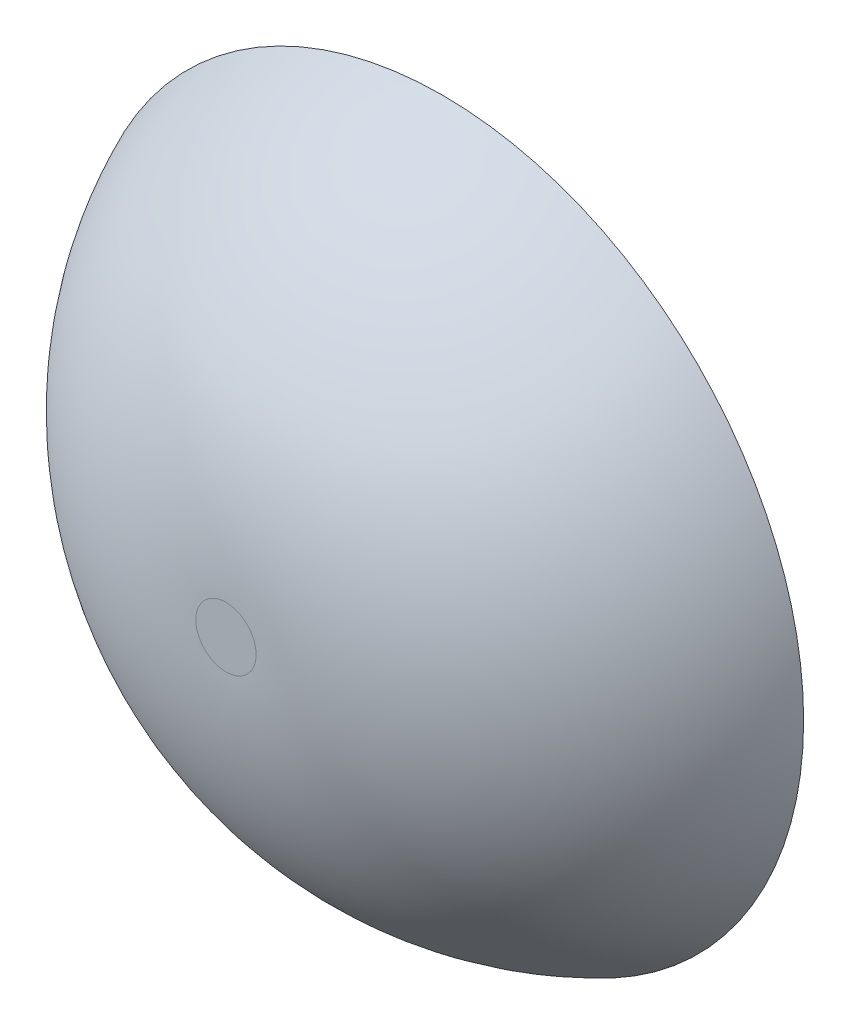
ISO-10303-21;
HEADER;
FILE_DESCRIPTION(('STEP AP214'),'2;1');
FILE_NAME('part.step','',(''),(''),'','','');
FILE_SCHEMA(('AUTOMOTIVE_DESIGN { 1 0 10303 214 1 1 1 1 }'));
ENDSEC;
DATA;
#1=APPLICATION_CONTEXT('core data for automotive mechanical design processes');
#2=APPLICATION_PROTOCOL_DEFINITION('international standard','automotive_design',2000,#1);
#3=PRODUCT_CONTEXT('',#1,'mechanical');
#4=PRODUCT('Part','Part','',(#3));
#5=PRODUCT_RELATED_PRODUCT_CATEGORY('part','',(#4));
#6=PRODUCT_DEFINITION_FORMATION('','',#4);
#7=PRODUCT_DEFINITION_CONTEXT('part definition',#1,'design');
#8=PRODUCT_DEFINITION('design','',#6,#7);
#9=PRODUCT_DEFINITION_SHAPE('','',#8);
#10=(LENGTH_UNIT() NAMED_UNIT(*) SI_UNIT(.MILLI.,.METRE.));
#11=(NAMED_UNIT(*) PLANE_ANGLE_UNIT() SI_UNIT($,.RADIAN.));
#12=(NAMED_UNIT(*) SI_UNIT($,.STERADIAN.) SOLID_ANGLE_UNIT());
#13=UNCERTAINTY_MEASURE_WITH_UNIT(LENGTH_MEASURE(1.E-05),#10,'distance_accuracy_value','');
#14=(GEOMETRIC_REPRESENTATION_CONTEXT(3) GLOBAL_UNCERTAINTY_ASSIGNED_CONTEXT((#13)) GLOBAL_UNIT_ASSIGNED_CONTEXT((#10,
#11,#12)) REPRESENTATION_CONTEXT('',''));
#15=CARTESIAN_POINT('',(0.,0.,0.));
#16=DIRECTION('',(0.,0.,1.));
#17=DIRECTION('',(1.,0.,0.));
#18=AXIS2_PLACEMENT_3D('',#15,#16,#17);
#19=CARTESIAN_POINT('',(0.,0.,3.75));
#20=DIRECTION('',(0.,0.,1.));
#21=DIRECTION('',(1.,0.,0.));
#22=AXIS2_PLACEMENT_3D('',#19,#20,#21);
#23=PLANE('',#22);
#24=CARTESIAN_POINT('',(-2.,2.,3.75));
#25=DIRECTION('',(0.,0.,-1.));
#26=DIRECTION('',(0.,-1.,0.));
#27=AXIS2_PLACEMENT_3D('',#24,#25,#26);
#28=CIRCLE('',#27,0.0417424305044199);
#29=CARTESIAN_POINT('',(-2.,1.95825756949558,3.75));
#30=VERTEX_POINT('',#29);
#31=CARTESIAN_POINT('',(-2.,2.04174243050442,3.75));
#32=VERTEX_POINT('',#31);
#33=EDGE_CURVE('E36',#30,#32,#28,.T.);
#34=ORIENTED_EDGE('',*,*,#33,.F.);
#35=CARTESIAN_POINT('',(-2.,2.,3.75));
#36=DIRECTION('',(0.,0.,-1.));
#37=DIRECTION('',(0.,1.,0.));
#38=AXIS2_PLACEMENT_3D('',#35,#36,#37);
#39=CIRCLE('',#38,0.0417424305044199);
#40=EDGE_CURVE('E27',#32,#30,#39,.T.);
#41=ORIENTED_EDGE('',*,*,#40,.F.);
#42=EDGE_LOOP('',(#34,#41));
#43=FACE_BOUND('',#42,.T.);
#44=ADVANCED_FACE('F17',(#43),#23,.T.);
#45=CARTESIAN_POINT('',(-2.,2.04174243050442,3.25));
#46=DIRECTION('',(-1.,0.,0.));
#47=DIRECTION('',(0.,1.,0.));
#48=AXIS2_PLACEMENT_3D('',#45,#46,#47);
#49=CIRCLE('',#48,0.5);
#50=TRIMMED_CURVE('',#49,(PARAMETER_VALUE(-1.65437847094237)),
(PARAMETER_VALUE(1.65437847094237)),.T.,.PARAMETER.);
#51=CARTESIAN_POINT('',(-2.,2.,3.25));
#52=DIRECTION('',(0.,0.,1.));
#53=AXIS1_PLACEMENT('',#51,#52);
#54=SURFACE_OF_REVOLUTION('',#50,#53);
#55=ORIENTED_EDGE('',*,*,#33,.T.);
#56=ORIENTED_EDGE('',*,*,#40,.T.);
#57=EDGE_LOOP('',(#55,#56));
#58=FACE_BOUND('',#57,.T.);
#59=CARTESIAN_POINT('',(-2.,2.,3.45));
#60=DIRECTION('',(0.,0.,1.));
#61=DIRECTION('',(1.,0.,0.));
#62=AXIS2_PLACEMENT_3D('',#59,#60,#61);
#63=CIRCLE('',#62,0.5);
#64=CARTESIAN_POINT('',(-1.5,2.,3.45));
#65=VERTEX_POINT('',#64);
#66=EDGE_CURVE('E11',#65,#65,#63,.T.);
#67=ORIENTED_EDGE('',*,*,#66,.T.);
#68=EDGE_LOOP('',(#67));
#69=FACE_BOUND('',#68,.T.);
#70=ADVANCED_FACE('F37',(#58,#69),#54,.F.);
#71=CARTESIAN_POINT('',(0.,0.,3.45));
#72=DIRECTION('',(0.,0.,1.));
#73=DIRECTION('',(1.,0.,0.));
#74=AXIS2_PLACEMENT_3D('',#71,#72,#73);
#75=PLANE('',#74);
#76=ORIENTED_EDGE('',*,*,#66,.F.);
#77=EDGE_LOOP('',(#76));
#78=FACE_BOUND('',#77,.T.);
#79=ADVANCED_FACE('F65',(#78),#75,.F.);
#80=CLOSED_SHELL('',(#44,#70,#79));
#81=MANIFOLD_SOLID_BREP('B1',#80);
#82=ADVANCED_BREP_SHAPE_REPRESENTATION('',(#18,#81),#14);
#83=SHAPE_DEFINITION_REPRESENTATION(#9,#82);
ENDSEC;
END-ISO-10303-21;
